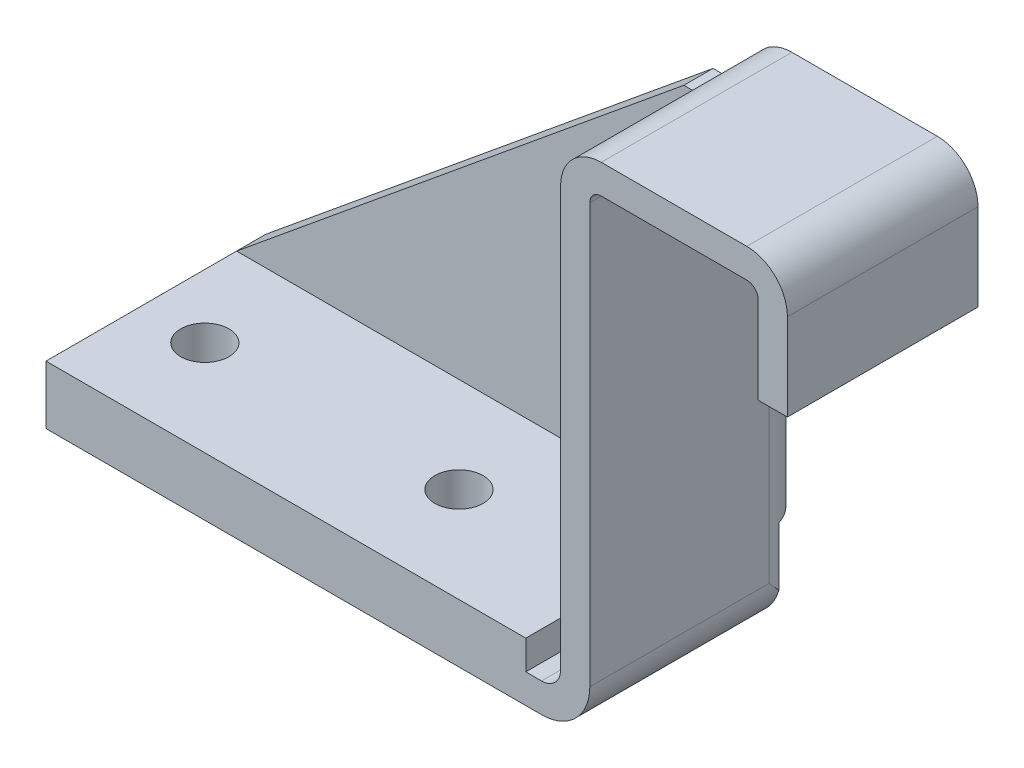
ISO-10303-21;
HEADER;
FILE_DESCRIPTION(('STEP AP214'),'2;1');
FILE_NAME('part.step','',(''),(''),'','','');
FILE_SCHEMA(('AUTOMOTIVE_DESIGN { 1 0 10303 214 1 1 1 1 }'));
ENDSEC;
DATA;
#1=APPLICATION_CONTEXT('core data for automotive mechanical design processes');
#2=APPLICATION_PROTOCOL_DEFINITION('international standard','automotive_design',2000,#1);
#3=PRODUCT_CONTEXT('',#1,'mechanical');
#4=PRODUCT('Part','Part','',(#3));
#5=PRODUCT_RELATED_PRODUCT_CATEGORY('part','',(#4));
#6=PRODUCT_DEFINITION_FORMATION('','',#4);
#7=PRODUCT_DEFINITION_CONTEXT('part definition',#1,'design');
#8=PRODUCT_DEFINITION('design','',#6,#7);
#9=PRODUCT_DEFINITION_SHAPE('','',#8);
#10=(LENGTH_UNIT() NAMED_UNIT(*) SI_UNIT(.MILLI.,.METRE.));
#11=(NAMED_UNIT(*) PLANE_ANGLE_UNIT() SI_UNIT($,.RADIAN.));
#12=(NAMED_UNIT(*) SI_UNIT($,.STERADIAN.) SOLID_ANGLE_UNIT());
#13=UNCERTAINTY_MEASURE_WITH_UNIT(LENGTH_MEASURE(1.E-05),#10,'distance_accuracy_value','');
#14=(GEOMETRIC_REPRESENTATION_CONTEXT(3) GLOBAL_UNCERTAINTY_ASSIGNED_CONTEXT((#13)) GLOBAL_UNIT_ASSIGNED_CONTEXT((#10,
#11,#12)) REPRESENTATION_CONTEXT('',''));
#15=CARTESIAN_POINT('',(0.,0.,0.));
#16=DIRECTION('',(0.,0.,1.));
#17=DIRECTION('',(1.,0.,0.));
#18=AXIS2_PLACEMENT_3D('',#15,#16,#17);
#19=CARTESIAN_POINT('',(356.4255,792.226,0.));
#20=DIRECTION('',(0.,0.,-1.));
#21=DIRECTION('',(-1.,0.,0.));
#22=AXIS2_PLACEMENT_3D('',#19,#20,#21);
#23=PLANE('',#22);
#24=DIRECTION('',(1.,0.,0.));
#25=VECTOR('',#24,1.);
#26=CARTESIAN_POINT('',(361.2515,796.82051965016,0.));
#27=LINE('',#26,#25);
#28=CARTESIAN_POINT('',(358.3305,796.82051965016,0.));
#29=VERTEX_POINT('',#28);
#30=CARTESIAN_POINT('',(361.087454743327,796.82051965016,0.));
#31=VERTEX_POINT('',#30);
#32=EDGE_CURVE('E314',#29,#31,#27,.T.);
#33=ORIENTED_EDGE('',*,*,#32,.T.);
#34=DIRECTION('',(0.,-1.,0.));
#35=VECTOR('',#34,1.);
#36=CARTESIAN_POINT('',(361.087454743327,796.82051965016,0.));
#37=LINE('',#36,#35);
#38=CARTESIAN_POINT('',(361.087454743327,790.978420755555,0.));
#39=VERTEX_POINT('',#38);
#40=EDGE_CURVE('E42',#31,#39,#37,.T.);
#41=ORIENTED_EDGE('',*,*,#40,.T.);
#42=CARTESIAN_POINT('',(356.4255,792.226,0.));
#43=DIRECTION('',(0.,0.,1.));
#44=DIRECTION('',(1.,0.,0.));
#45=AXIS2_PLACEMENT_3D('',#42,#43,#44);
#46=CIRCLE('',#45,4.826);
#47=CARTESIAN_POINT('',(356.4255,787.4,0.));
#48=VERTEX_POINT('',#47);
#49=EDGE_CURVE('E464',#48,#39,#46,.T.);
#50=ORIENTED_EDGE('',*,*,#49,.F.);
#51=DIRECTION('',(1.,0.,0.));
#52=VECTOR('',#51,1.);
#53=CARTESIAN_POINT('',(306.8955,787.4,0.));
#54=LINE('',#53,#52);
#55=CARTESIAN_POINT('',(306.8955,787.4,0.));
#56=VERTEX_POINT('',#55);
#57=EDGE_CURVE('E307',#56,#48,#54,.T.);
#58=ORIENTED_EDGE('',*,*,#57,.F.);
#59=DIRECTION('',(0.,-1.,0.));
#60=VECTOR('',#59,1.);
#61=CARTESIAN_POINT('',(306.8955,790.321,0.));
#62=LINE('',#61,#60);
#63=CARTESIAN_POINT('',(306.8955,790.321,0.));
#64=VERTEX_POINT('',#63);
#65=EDGE_CURVE('E304',#64,#56,#62,.T.);
#66=ORIENTED_EDGE('',*,*,#65,.F.);
#67=DIRECTION('',(1.,0.,0.));
#68=VECTOR('',#67,1.);
#69=CARTESIAN_POINT('',(354.8507,790.321,0.));
#70=LINE('',#69,#68);
#71=CARTESIAN_POINT('',(354.8507,790.321,0.));
#72=VERTEX_POINT('',#71);
#73=EDGE_CURVE('E248',#64,#72,#70,.T.);
#74=ORIENTED_EDGE('',*,*,#73,.T.);
#75=DIRECTION('',(-1.,0.,0.));
#76=VECTOR('',#75,1.);
#77=CARTESIAN_POINT('',(356.4255,790.321,0.));
#78=LINE('',#77,#76);
#79=CARTESIAN_POINT('',(356.4255,790.321,0.));
#80=VERTEX_POINT('',#79);
#81=EDGE_CURVE('E301',#80,#72,#78,.T.);
#82=ORIENTED_EDGE('',*,*,#81,.F.);
#83=CARTESIAN_POINT('',(356.4255,792.226,0.));
#84=DIRECTION('',(0.,0.,-1.));
#85=DIRECTION('',(-1.,0.,0.));
#86=AXIS2_PLACEMENT_3D('',#83,#84,#85);
#87=CIRCLE('',#86,1.90499999999999);
#88=CARTESIAN_POINT('',(358.3305,792.226,0.));
#89=VERTEX_POINT('',#88);
#90=EDGE_CURVE('E262',#89,#80,#87,.T.);
#91=ORIENTED_EDGE('',*,*,#90,.F.);
#92=DIRECTION('',(0.,-1.,0.));
#93=VECTOR('',#92,1.);
#94=CARTESIAN_POINT('',(358.3305,834.136,0.));
#95=LINE('',#94,#93);
#96=EDGE_CURVE('E379',#29,#89,#95,.T.);
#97=ORIENTED_EDGE('',*,*,#96,.F.);
#98=EDGE_LOOP('',(#33,#41,#50,#58,#66,#74,#82,#91,#97));
#99=FACE_BOUND('',#98,.T.);
#100=ADVANCED_FACE('F32',(#99),#23,.T.);
#101=CARTESIAN_POINT('',(362.3945,834.136,0.));
#102=DIRECTION('',(0.,0.,-1.));
#103=DIRECTION('',(-1.,0.,0.));
#104=AXIS2_PLACEMENT_3D('',#101,#102,#103);
#105=CIRCLE('',#104,1.30704525667288);
#106=CARTESIAN_POINT('',(363.028470269801,835.279,0.));
#107=VERTEX_POINT('',#106);
#108=CARTESIAN_POINT('',(361.087454743327,834.136,0.));
#109=VERTEX_POINT('',#108);
#110=EDGE_CURVE('E341',#107,#109,#105,.F.);
#111=ORIENTED_EDGE('',*,*,#110,.T.);
#112=DIRECTION('',(0.,-1.,0.));
#113=VECTOR('',#112,1.);
#114=CARTESIAN_POINT('',(361.087454743327,834.136,0.));
#115=LINE('',#114,#113);
#116=CARTESIAN_POINT('',(361.087454743327,829.945,0.));
#117=VERTEX_POINT('',#116);
#118=EDGE_CURVE('E573',#109,#117,#115,.T.);
#119=ORIENTED_EDGE('',*,*,#118,.T.);
#120=DIRECTION('',(-1.,0.,0.));
#121=VECTOR('',#120,1.);
#122=CARTESIAN_POINT('',(351.5995,829.945,0.));
#123=LINE('',#122,#121);
#124=CARTESIAN_POINT('',(358.3305,829.945,0.));
#125=VERTEX_POINT('',#124);
#126=EDGE_CURVE('E342',#117,#125,#123,.T.);
#127=ORIENTED_EDGE('',*,*,#126,.T.);
#128=CARTESIAN_POINT('',(358.3305,834.136,0.));
#129=VERTEX_POINT('',#128);
#130=EDGE_CURVE('E267',#129,#125,#95,.T.);
#131=ORIENTED_EDGE('',*,*,#130,.F.);
#132=CARTESIAN_POINT('',(362.3945,834.136,0.));
#133=DIRECTION('',(0.,0.,1.));
#134=DIRECTION('',(1.,0.,0.));
#135=AXIS2_PLACEMENT_3D('',#132,#133,#134);
#136=CIRCLE('',#135,4.06399999999998);
#137=CARTESIAN_POINT('',(362.3945,838.2,0.));
#138=VERTEX_POINT('',#137);
#139=EDGE_CURVE('E383',#138,#129,#136,.T.);
#140=ORIENTED_EDGE('',*,*,#139,.F.);
#141=DIRECTION('',(-1.,0.,0.));
#142=VECTOR('',#141,1.);
#143=CARTESIAN_POINT('',(376.936,838.2,0.));
#144=LINE('',#143,#142);
#145=CARTESIAN_POINT('',(376.936,838.2,0.));
#146=VERTEX_POINT('',#145);
#147=EDGE_CURVE('E450',#146,#138,#144,.T.);
#148=ORIENTED_EDGE('',*,*,#147,.F.);
#149=CARTESIAN_POINT('',(376.936,834.136,0.));
#150=DIRECTION('',(0.,0.,1.));
#151=DIRECTION('',(1.,0.,0.));
#152=AXIS2_PLACEMENT_3D('',#149,#150,#151);
#153=CIRCLE('',#152,4.06399999999987);
#154=CARTESIAN_POINT('',(381.,834.136,0.));
#155=VERTEX_POINT('',#154);
#156=EDGE_CURVE('E451',#155,#146,#153,.T.);
#157=ORIENTED_EDGE('',*,*,#156,.F.);
#158=DIRECTION('',(0.,1.,0.));
#159=VECTOR('',#158,1.);
#160=CARTESIAN_POINT('',(381.,825.4492,0.));
#161=LINE('',#160,#159);
#162=CARTESIAN_POINT('',(381.,825.4492,0.));
#163=VERTEX_POINT('',#162);
#164=EDGE_CURVE('E453',#163,#155,#161,.T.);
#165=ORIENTED_EDGE('',*,*,#164,.F.);
#166=DIRECTION('',(1.,0.,0.));
#167=VECTOR('',#166,1.);
#168=CARTESIAN_POINT('',(378.079,825.4492,0.));
#169=LINE('',#168,#167);
#170=CARTESIAN_POINT('',(378.079,825.4492,0.));
#171=VERTEX_POINT('',#170);
#172=EDGE_CURVE('E457',#171,#163,#169,.T.);
#173=ORIENTED_EDGE('',*,*,#172,.F.);
#174=DIRECTION('',(0.,-1.,0.));
#175=VECTOR('',#174,1.);
#176=CARTESIAN_POINT('',(378.079,834.136,0.));
#177=LINE('',#176,#175);
#178=CARTESIAN_POINT('',(378.079,834.136,0.));
#179=VERTEX_POINT('',#178);
#180=EDGE_CURVE('E459',#179,#171,#177,.T.);
#181=ORIENTED_EDGE('',*,*,#180,.F.);
#182=CARTESIAN_POINT('',(376.936,834.136,0.));
#183=DIRECTION('',(0.,0.,-1.));
#184=DIRECTION('',(-1.,0.,0.));
#185=AXIS2_PLACEMENT_3D('',#182,#183,#184);
#186=CIRCLE('',#185,1.14300000000001);
#187=CARTESIAN_POINT('',(376.936,835.279,0.));
#188=VERTEX_POINT('',#187);
#189=EDGE_CURVE('E461',#188,#179,#186,.T.);
#190=ORIENTED_EDGE('',*,*,#189,.F.);
#191=DIRECTION('',(1.,0.,0.));
#192=VECTOR('',#191,1.);
#193=CARTESIAN_POINT('',(362.3945,835.279,0.));
#194=LINE('',#193,#192);
#195=EDGE_CURVE('E463',#107,#188,#194,.T.);
#196=ORIENTED_EDGE('',*,*,#195,.F.);
#197=EDGE_LOOP('',(#111,#119,#127,#131,#140,#148,#157,#165,#173,#181,#190,#196));
#198=FACE_BOUND('',#197,.T.);
#199=ADVANCED_FACE('F514',(#198),#23,.T.);
#200=CARTESIAN_POINT('',(356.4255,790.321,19.0500000000001));
#201=DIRECTION('',(0.,-1.,0.));
#202=DIRECTION('',(1.,0.,0.));
#203=AXIS2_PLACEMENT_3D('',#200,#201,#202);
#204=PLANE('',#203);
#205=DIRECTION('',(0.,0.,-1.));
#206=VECTOR('',#205,1.);
#207=CARTESIAN_POINT('',(354.8507,790.321,19.0500000000001));
#208=LINE('',#207,#206);
#209=CARTESIAN_POINT('',(354.8507,790.321,19.0500000000001));
#210=VERTEX_POINT('',#209);
#211=EDGE_CURVE('E257',#210,#72,#208,.T.);
#212=ORIENTED_EDGE('',*,*,#211,.F.);
#213=DIRECTION('',(-1.,0.,0.));
#214=VECTOR('',#213,1.);
#215=CARTESIAN_POINT('',(356.4255,790.321,19.0500000000001));
#216=LINE('',#215,#214);
#217=CARTESIAN_POINT('',(356.4255,790.321,19.0500000000001));
#218=VERTEX_POINT('',#217);
#219=EDGE_CURVE('E266',#218,#210,#216,.T.);
#220=ORIENTED_EDGE('',*,*,#219,.F.);
#221=DIRECTION('',(0.,0.,-1.));
#222=VECTOR('',#221,1.);
#223=CARTESIAN_POINT('',(356.4255,790.321,19.0500000000001));
#224=LINE('',#223,#222);
#225=EDGE_CURVE('E312',#218,#80,#224,.T.);
#226=ORIENTED_EDGE('',*,*,#225,.T.);
#227=ORIENTED_EDGE('',*,*,#81,.T.);
#228=EDGE_LOOP('',(#212,#220,#226,#227));
#229=FACE_BOUND('',#228,.T.);
#230=ADVANCED_FACE('F434',(#229),#204,.F.);
#231=CARTESIAN_POINT('',(356.4255,792.226,19.0500000000001));
#232=DIRECTION('',(0.,0.,-1.));
#233=DIRECTION('',(-1.,0.,0.));
#234=AXIS2_PLACEMENT_3D('',#231,#232,#233);
#235=CYLINDRICAL_SURFACE('',#234,1.90499999999999);
#236=ORIENTED_EDGE('',*,*,#90,.T.);
#237=ORIENTED_EDGE('',*,*,#225,.F.);
#238=CARTESIAN_POINT('',(356.4255,792.226,19.0500000000001));
#239=DIRECTION('',(0.,0.,-1.));
#240=DIRECTION('',(-1.,0.,0.));
#241=AXIS2_PLACEMENT_3D('',#238,#239,#240);
#242=CIRCLE('',#241,1.90499999999999);
#243=CARTESIAN_POINT('',(358.3305,792.226,19.0500000000001));
#244=VERTEX_POINT('',#243);
#245=EDGE_CURVE('E263',#244,#218,#242,.T.);
#246=ORIENTED_EDGE('',*,*,#245,.F.);
#247=DIRECTION('',(0.,0.,-1.));
#248=VECTOR('',#247,1.);
#249=CARTESIAN_POINT('',(358.3305,792.226,19.0500000000001));
#250=LINE('',#249,#248);
#251=EDGE_CURVE('E298',#244,#89,#250,.T.);
#252=ORIENTED_EDGE('',*,*,#251,.T.);
#253=EDGE_LOOP('',(#236,#237,#246,#252));
#254=FACE_BOUND('',#253,.T.);
#255=ADVANCED_FACE('F437',(#254),#235,.F.);
#256=CARTESIAN_POINT('',(306.8955,790.321,19.0500000000001));
#257=DIRECTION('',(1.,0.,0.));
#258=DIRECTION('',(0.,0.,-1.));
#259=AXIS2_PLACEMENT_3D('',#256,#257,#258);
#260=PLANE('',#259);
#261=DIRECTION('',(0.,0.,1.));
#262=VECTOR('',#261,1.);
#263=CARTESIAN_POINT('',(306.8955,793.242,-2.92100000000001));
#264=LINE('',#263,#262);
#265=CARTESIAN_POINT('',(306.8955,793.242,-2.8013305655735));
#266=VERTEX_POINT('',#265);
#267=CARTESIAN_POINT('',(306.8955,793.242,0.));
#268=VERTEX_POINT('',#267);
#269=EDGE_CURVE('E322',#266,#268,#264,.T.);
#270=ORIENTED_EDGE('',*,*,#269,.F.);
#271=CARTESIAN_POINT('',(306.8955,794.220954743327,1.14300000000001));
#272=DIRECTION('',(1.,0.,0.));
#273=DIRECTION('',(0.,0.,-1.));
#274=AXIS2_PLACEMENT_3D('',#271,#272,#273);
#275=CIRCLE('',#274,4.064);
#276=EDGE_CURVE('E334',#266,#64,#275,.F.);
#277=ORIENTED_EDGE('',*,*,#276,.T.);
#278=ORIENTED_EDGE('',*,*,#65,.T.);
#279=DIRECTION('',(0.,0.,-1.));
#280=VECTOR('',#279,1.);
#281=CARTESIAN_POINT('',(306.8955,787.4,19.0500000000001));
#282=LINE('',#281,#280);
#283=CARTESIAN_POINT('',(306.8955,787.4,19.0500000000001));
#284=VERTEX_POINT('',#283);
#285=EDGE_CURVE('E426',#284,#56,#282,.T.);
#286=ORIENTED_EDGE('',*,*,#285,.F.);
#287=DIRECTION('',(0.,-1.,0.));
#288=VECTOR('',#287,1.);
#289=CARTESIAN_POINT('',(306.8955,790.321,19.0500000000001));
#290=LINE('',#289,#288);
#291=CARTESIAN_POINT('',(306.8955,793.242,19.0500000000001));
#292=VERTEX_POINT('',#291);
#293=EDGE_CURVE('E270',#292,#284,#290,.T.);
#294=ORIENTED_EDGE('',*,*,#293,.F.);
#295=DIRECTION('',(0.,0.,-1.));
#296=VECTOR('',#295,1.);
#297=CARTESIAN_POINT('',(306.8955,793.242,19.0500000000001));
#298=LINE('',#297,#296);
#299=EDGE_CURVE('E259',#292,#268,#298,.T.);
#300=ORIENTED_EDGE('',*,*,#299,.T.);
#301=EDGE_LOOP('',(#270,#277,#278,#286,#294,#300));
#302=FACE_BOUND('',#301,.T.);
#303=ADVANCED_FACE('F366',(#302),#260,.F.);
#304=CARTESIAN_POINT('',(306.8955,787.4,19.0500000000001));
#305=DIRECTION('',(0.,1.,0.));
#306=DIRECTION('',(0.,0.,1.));
#307=AXIS2_PLACEMENT_3D('',#304,#305,#306);
#308=PLANE('',#307);
#309=CARTESIAN_POINT('',(338.6455,787.4,9.52500000000006));
#310=DIRECTION('',(0.,-1.,0.));
#311=DIRECTION('',(0.,0.,-1.));
#312=AXIS2_PLACEMENT_3D('',#309,#310,#311);
#313=CIRCLE('',#312,2.41299999999999);
#314=CARTESIAN_POINT('',(338.6455,787.4,7.11200000000006));
#315=VERTEX_POINT('',#314);
#316=EDGE_CURVE('E606',#315,#315,#313,.T.);
#317=ORIENTED_EDGE('',*,*,#316,.F.);
#318=EDGE_LOOP('',(#317));
#319=FACE_BOUND('',#318,.T.);
#320=CARTESIAN_POINT('',(313.2455,787.4,9.52500000000006));
#321=DIRECTION('',(0.,-1.,0.));
#322=DIRECTION('',(0.,0.,-1.));
#323=AXIS2_PLACEMENT_3D('',#320,#321,#322);
#324=CIRCLE('',#323,2.41299999999999);
#325=CARTESIAN_POINT('',(313.2455,787.4,7.11200000000006));
#326=VERTEX_POINT('',#325);
#327=EDGE_CURVE('E597',#326,#326,#324,.T.);
#328=ORIENTED_EDGE('',*,*,#327,.F.);
#329=EDGE_LOOP('',(#328));
#330=FACE_BOUND('',#329,.T.);
#331=ORIENTED_EDGE('',*,*,#57,.T.);
#332=DIRECTION('',(0.,0.,-1.));
#333=VECTOR('',#332,1.);
#334=CARTESIAN_POINT('',(356.4255,787.4,19.0500000000001));
#335=LINE('',#334,#333);
#336=CARTESIAN_POINT('',(356.4255,787.4,19.0500000000001));
#337=VERTEX_POINT('',#336);
#338=EDGE_CURVE('E424',#337,#48,#335,.T.);
#339=ORIENTED_EDGE('',*,*,#338,.F.);
#340=DIRECTION('',(1.,0.,0.));
#341=VECTOR('',#340,1.);
#342=CARTESIAN_POINT('',(306.8955,787.4,19.0500000000001));
#343=LINE('',#342,#341);
#344=EDGE_CURVE('E272',#284,#337,#343,.T.);
#345=ORIENTED_EDGE('',*,*,#344,.F.);
#346=ORIENTED_EDGE('',*,*,#285,.T.);
#347=EDGE_LOOP('',(#331,#339,#345,#346));
#348=FACE_BOUND('',#347,.T.);
#349=ADVANCED_FACE('F468',(#319,#330,#348),#308,.F.);
#350=CARTESIAN_POINT('',(356.4255,792.226,19.0500000000001));
#351=DIRECTION('',(0.,0.,-1.));
#352=DIRECTION('',(-1.,0.,0.));
#353=AXIS2_PLACEMENT_3D('',#350,#351,#352);
#354=CYLINDRICAL_SURFACE('',#353,4.826);
#355=ORIENTED_EDGE('',*,*,#49,.T.);
#356=CARTESIAN_POINT('',(361.087454743327,790.978420755555,0.));
#357=CARTESIAN_POINT('',(361.114795327784,791.080621794301,0.0933195113702025));
#358=CARTESIAN_POINT('',(361.138663268097,791.183234788616,0.187135363436242));
#359=CARTESIAN_POINT('',(361.179548210284,791.389134706904,0.375561001679142));
#360=CARTESIAN_POINT('',(361.196563840431,791.492421761613,0.470170942954715));
#361=CARTESIAN_POINT('',(361.237322971748,791.801970083546,0.753886615539928));
#362=CARTESIAN_POINT('',(361.251050548197,792.008946069466,0.943817704125921));
#363=CARTESIAN_POINT('',(361.251496379332,792.219175476468,1.13673738787016));
#364=CARTESIAN_POINT('',(361.251499998218,792.222587762367,1.13986871616857));
#365=CARTESIAN_POINT('',(361.2515,792.226,1.14300000000001));
#366=B_SPLINE_CURVE_WITH_KNOTS('',3,(#356,#357,#358,#359,#360,#361,#362,#363,#364,#365),
.UNSPECIFIED.,.F.,.F.,(4,2,2,2,4),(0.,0.423080849383119,0.846246351027394,1.6883378195487,
1.70223170733719),.UNSPECIFIED.);
#367=CARTESIAN_POINT('',(361.2515,792.226,1.14300000000001));
#368=VERTEX_POINT('',#367);
#369=EDGE_CURVE('E11',#39,#368,#366,.T.);
#370=ORIENTED_EDGE('',*,*,#369,.T.);
#371=DIRECTION('',(0.,0.,-1.));
#372=VECTOR('',#371,1.);
#373=CARTESIAN_POINT('',(361.2515,792.226,19.0500000000001));
#374=LINE('',#373,#372);
#375=CARTESIAN_POINT('',(361.2515,792.226,19.0500000000001));
#376=VERTEX_POINT('',#375);
#377=EDGE_CURVE('E421',#376,#368,#374,.T.);
#378=ORIENTED_EDGE('',*,*,#377,.F.);
#379=CARTESIAN_POINT('',(356.4255,792.226,19.0500000000001));
#380=DIRECTION('',(0.,0.,1.));
#381=DIRECTION('',(1.,0.,0.));
#382=AXIS2_PLACEMENT_3D('',#379,#380,#381);
#383=CIRCLE('',#382,4.826);
#384=EDGE_CURVE('E274',#337,#376,#383,.T.);
#385=ORIENTED_EDGE('',*,*,#384,.F.);
#386=ORIENTED_EDGE('',*,*,#338,.T.);
#387=EDGE_LOOP('',(#355,#370,#378,#385,#386));
#388=FACE_BOUND('',#387,.T.);
#389=ADVANCED_FACE('F471',(#388),#354,.T.);
#390=CARTESIAN_POINT('',(361.2515,792.226,19.0500000000001));
#391=DIRECTION('',(-1.,0.,0.));
#392=DIRECTION('',(0.,0.,1.));
#393=AXIS2_PLACEMENT_3D('',#390,#391,#392);
#394=PLANE('',#393);
#395=ORIENTED_EDGE('',*,*,#377,.T.);
#396=DIRECTION('',(0.,1.,0.));
#397=VECTOR('',#396,1.);
#398=CARTESIAN_POINT('',(361.2515,829.945,1.14300000000001));
#399=LINE('',#398,#397);
#400=CARTESIAN_POINT('',(361.2515,834.136,1.14300000000001));
#401=VERTEX_POINT('',#400);
#402=EDGE_CURVE('E336',#368,#401,#399,.T.);
#403=ORIENTED_EDGE('',*,*,#402,.T.);
#404=DIRECTION('',(0.,0.,-1.));
#405=VECTOR('',#404,1.);
#406=CARTESIAN_POINT('',(361.2515,834.136,19.0500000000001));
#407=LINE('',#406,#405);
#408=CARTESIAN_POINT('',(361.2515,834.136,19.0500000000001));
#409=VERTEX_POINT('',#408);
#410=EDGE_CURVE('E418',#409,#401,#407,.T.);
#411=ORIENTED_EDGE('',*,*,#410,.F.);
#412=DIRECTION('',(0.,1.,0.));
#413=VECTOR('',#412,1.);
#414=CARTESIAN_POINT('',(361.2515,792.226,19.0500000000001));
#415=LINE('',#414,#413);
#416=EDGE_CURVE('E276',#376,#409,#415,.T.);
#417=ORIENTED_EDGE('',*,*,#416,.F.);
#418=EDGE_LOOP('',(#395,#403,#411,#417));
#419=FACE_BOUND('',#418,.T.);
#420=ADVANCED_FACE('F505',(#419),#394,.F.);
#421=CARTESIAN_POINT('',(362.3945,834.136,19.0500000000001));
#422=DIRECTION('',(0.,0.,-1.));
#423=DIRECTION('',(-1.,0.,0.));
#424=AXIS2_PLACEMENT_3D('',#421,#422,#423);
#425=CYLINDRICAL_SURFACE('',#424,1.14300000000003);
#426=ORIENTED_EDGE('',*,*,#410,.T.);
#427=CARTESIAN_POINT('',(362.3945,834.136,1.14300000000001));
#428=DIRECTION('',(0.,0.,-1.));
#429=DIRECTION('',(-1.,0.,0.));
#430=AXIS2_PLACEMENT_3D('',#427,#428,#429);
#431=CIRCLE('',#430,1.14300000000003);
#432=CARTESIAN_POINT('',(362.3945,835.279,1.14300000000001));
#433=VERTEX_POINT('',#432);
#434=EDGE_CURVE('E487',#401,#433,#431,.T.);
#435=ORIENTED_EDGE('',*,*,#434,.T.);
#436=DIRECTION('',(0.,0.,-1.));
#437=VECTOR('',#436,1.);
#438=CARTESIAN_POINT('',(362.3945,835.279,19.0500000000001));
#439=LINE('',#438,#437);
#440=CARTESIAN_POINT('',(362.3945,835.279,19.0500000000001));
#441=VERTEX_POINT('',#440);
#442=EDGE_CURVE('E415',#441,#433,#439,.T.);
#443=ORIENTED_EDGE('',*,*,#442,.F.);
#444=CARTESIAN_POINT('',(362.3945,834.136,19.0500000000001));
#445=DIRECTION('',(0.,0.,-1.));
#446=DIRECTION('',(-1.,0.,0.));
#447=AXIS2_PLACEMENT_3D('',#444,#445,#446);
#448=CIRCLE('',#447,1.14300000000003);
#449=EDGE_CURVE('E278',#409,#441,#448,.T.);
#450=ORIENTED_EDGE('',*,*,#449,.F.);
#451=EDGE_LOOP('',(#426,#435,#443,#450));
#452=FACE_BOUND('',#451,.T.);
#453=ADVANCED_FACE('F560',(#452),#425,.F.);
#454=CARTESIAN_POINT('',(362.3945,835.279,19.0500000000001));
#455=DIRECTION('',(0.,1.,0.));
#456=DIRECTION('',(0.,0.,1.));
#457=AXIS2_PLACEMENT_3D('',#454,#455,#456);
#458=PLANE('',#457);
#459=ORIENTED_EDGE('',*,*,#442,.T.);
#460=CARTESIAN_POINT('',(363.028470269801,835.279,0.));
#461=CARTESIAN_POINT('',(362.916849340827,835.279,0.184615844499899));
#462=CARTESIAN_POINT('',(362.810442364593,835.279,0.372154180899349));
#463=CARTESIAN_POINT('',(362.602817617344,835.279,0.750366541628903));
#464=CARTESIAN_POINT('',(362.501605351557,835.279,0.941043620865379));
#465=CARTESIAN_POINT('',(362.398482389956,835.279,1.1354907193236));
#466=CARTESIAN_POINT('',(362.396491189189,835.279,1.13924536224221));
#467=CARTESIAN_POINT('',(362.3945,835.279,1.14300000000001));
#468=B_SPLINE_CURVE_WITH_KNOTS('',3,(#460,#461,#462,#463,#464,#465,#466,#467),.UNSPECIFIED.,.F.,
.F.,(4,2,2,4),(0.,0.646876716528991,1.29442539148645,1.30717529342893),.UNSPECIFIED.);
#469=EDGE_CURVE('E484',#433,#107,#468,.F.);
#470=ORIENTED_EDGE('',*,*,#469,.T.);
#471=ORIENTED_EDGE('',*,*,#195,.T.);
#472=DIRECTION('',(0.,0.,-1.));
#473=VECTOR('',#472,1.);
#474=CARTESIAN_POINT('',(376.936,835.279,19.0500000000001));
#475=LINE('',#474,#473);
#476=CARTESIAN_POINT('',(376.936,835.279,19.0500000000001));
#477=VERTEX_POINT('',#476);
#478=EDGE_CURVE('E412',#477,#188,#475,.T.);
#479=ORIENTED_EDGE('',*,*,#478,.F.);
#480=DIRECTION('',(1.,0.,0.));
#481=VECTOR('',#480,1.);
#482=CARTESIAN_POINT('',(362.3945,835.279,19.0500000000001));
#483=LINE('',#482,#481);
#484=EDGE_CURVE('E280',#441,#477,#483,.T.);
#485=ORIENTED_EDGE('',*,*,#484,.F.);
#486=EDGE_LOOP('',(#459,#470,#471,#479,#485));
#487=FACE_BOUND('',#486,.T.);
#488=ADVANCED_FACE('F556',(#487),#458,.F.);
#489=CARTESIAN_POINT('',(376.936,834.136,19.0500000000001));
#490=DIRECTION('',(0.,0.,-1.));
#491=DIRECTION('',(-1.,0.,0.));
#492=AXIS2_PLACEMENT_3D('',#489,#490,#491);
#493=CYLINDRICAL_SURFACE('',#492,1.14300000000001);
#494=ORIENTED_EDGE('',*,*,#189,.T.);
#495=DIRECTION('',(0.,0.,-1.));
#496=VECTOR('',#495,1.);
#497=CARTESIAN_POINT('',(378.079,834.136,19.0500000000001));
#498=LINE('',#497,#496);
#499=CARTESIAN_POINT('',(378.079,834.136,19.0500000000001));
#500=VERTEX_POINT('',#499);
#501=EDGE_CURVE('E409',#500,#179,#498,.T.);
#502=ORIENTED_EDGE('',*,*,#501,.F.);
#503=CARTESIAN_POINT('',(376.936,834.136,19.0500000000001));
#504=DIRECTION('',(0.,0.,-1.));
#505=DIRECTION('',(-1.,0.,0.));
#506=AXIS2_PLACEMENT_3D('',#503,#504,#505);
#507=CIRCLE('',#506,1.14300000000001);
#508=EDGE_CURVE('E282',#477,#500,#507,.T.);
#509=ORIENTED_EDGE('',*,*,#508,.F.);
#510=ORIENTED_EDGE('',*,*,#478,.T.);
#511=EDGE_LOOP('',(#494,#502,#509,#510));
#512=FACE_BOUND('',#511,.T.);
#513=ADVANCED_FACE('F553',(#512),#493,.F.);
#514=CARTESIAN_POINT('',(378.079,834.136,19.0500000000001));
#515=DIRECTION('',(1.,0.,0.));
#516=DIRECTION('',(0.,0.,-1.));
#517=AXIS2_PLACEMENT_3D('',#514,#515,#516);
#518=PLANE('',#517);
#519=ORIENTED_EDGE('',*,*,#180,.T.);
#520=DIRECTION('',(0.,0.,-1.));
#521=VECTOR('',#520,1.);
#522=CARTESIAN_POINT('',(378.079,825.4492,19.0500000000001));
#523=LINE('',#522,#521);
#524=CARTESIAN_POINT('',(378.079,825.4492,19.0500000000001));
#525=VERTEX_POINT('',#524);
#526=EDGE_CURVE('E406',#525,#171,#523,.T.);
#527=ORIENTED_EDGE('',*,*,#526,.F.);
#528=DIRECTION('',(0.,-1.,0.));
#529=VECTOR('',#528,1.);
#530=CARTESIAN_POINT('',(378.079,834.136,19.0500000000001));
#531=LINE('',#530,#529);
#532=EDGE_CURVE('E284',#500,#525,#531,.T.);
#533=ORIENTED_EDGE('',*,*,#532,.F.);
#534=ORIENTED_EDGE('',*,*,#501,.T.);
#535=EDGE_LOOP('',(#519,#527,#533,#534));
#536=FACE_BOUND('',#535,.T.);
#537=ADVANCED_FACE('F549',(#536),#518,.F.);
#538=CARTESIAN_POINT('',(378.079,825.4492,19.0500000000001));
#539=DIRECTION('',(0.,1.,0.));
#540=DIRECTION('',(0.,0.,1.));
#541=AXIS2_PLACEMENT_3D('',#538,#539,#540);
#542=PLANE('',#541);
#543=ORIENTED_EDGE('',*,*,#172,.T.);
#544=DIRECTION('',(0.,0.,-1.));
#545=VECTOR('',#544,1.);
#546=CARTESIAN_POINT('',(381.,825.4492,19.0500000000001));
#547=LINE('',#546,#545);
#548=CARTESIAN_POINT('',(381.,825.4492,19.0500000000001));
#549=VERTEX_POINT('',#548);
#550=EDGE_CURVE('E403',#549,#163,#547,.T.);
#551=ORIENTED_EDGE('',*,*,#550,.F.);
#552=DIRECTION('',(1.,0.,0.));
#553=VECTOR('',#552,1.);
#554=CARTESIAN_POINT('',(378.079,825.4492,19.0500000000001));
#555=LINE('',#554,#553);
#556=EDGE_CURVE('E286',#525,#549,#555,.T.);
#557=ORIENTED_EDGE('',*,*,#556,.F.);
#558=ORIENTED_EDGE('',*,*,#526,.T.);
#559=EDGE_LOOP('',(#543,#551,#557,#558));
#560=FACE_BOUND('',#559,.T.);
#561=ADVANCED_FACE('F545',(#560),#542,.F.);
#562=CARTESIAN_POINT('',(381.,825.4492,19.0500000000001));
#563=DIRECTION('',(-1.,0.,0.));
#564=DIRECTION('',(0.,0.,1.));
#565=AXIS2_PLACEMENT_3D('',#562,#563,#564);
#566=PLANE('',#565);
#567=ORIENTED_EDGE('',*,*,#164,.T.);
#568=DIRECTION('',(0.,0.,-1.));
#569=VECTOR('',#568,1.);
#570=CARTESIAN_POINT('',(381.,834.136,19.0500000000001));
#571=LINE('',#570,#569);
#572=CARTESIAN_POINT('',(381.,834.136,19.0500000000001));
#573=VERTEX_POINT('',#572);
#574=EDGE_CURVE('E400',#573,#155,#571,.T.);
#575=ORIENTED_EDGE('',*,*,#574,.F.);
#576=DIRECTION('',(0.,1.,0.));
#577=VECTOR('',#576,1.);
#578=CARTESIAN_POINT('',(381.,825.4492,19.0500000000001));
#579=LINE('',#578,#577);
#580=EDGE_CURVE('E288',#549,#573,#579,.T.);
#581=ORIENTED_EDGE('',*,*,#580,.F.);
#582=ORIENTED_EDGE('',*,*,#550,.T.);
#583=EDGE_LOOP('',(#567,#575,#581,#582));
#584=FACE_BOUND('',#583,.T.);
#585=ADVANCED_FACE('F541',(#584),#566,.F.);
#586=CARTESIAN_POINT('',(376.936,834.136,19.0500000000001));
#587=DIRECTION('',(0.,0.,-1.));
#588=DIRECTION('',(-1.,0.,0.));
#589=AXIS2_PLACEMENT_3D('',#586,#587,#588);
#590=CYLINDRICAL_SURFACE('',#589,4.06399999999987);
#591=ORIENTED_EDGE('',*,*,#156,.T.);
#592=DIRECTION('',(0.,0.,-1.));
#593=VECTOR('',#592,1.);
#594=CARTESIAN_POINT('',(376.936,838.2,19.0500000000001));
#595=LINE('',#594,#593);
#596=CARTESIAN_POINT('',(376.936,838.2,19.0500000000001));
#597=VERTEX_POINT('',#596);
#598=EDGE_CURVE('E397',#597,#146,#595,.T.);
#599=ORIENTED_EDGE('',*,*,#598,.F.);
#600=CARTESIAN_POINT('',(376.936,834.136,19.0500000000001));
#601=DIRECTION('',(0.,0.,1.));
#602=DIRECTION('',(1.,0.,0.));
#603=AXIS2_PLACEMENT_3D('',#600,#601,#602);
#604=CIRCLE('',#603,4.06399999999987);
#605=EDGE_CURVE('E290',#573,#597,#604,.T.);
#606=ORIENTED_EDGE('',*,*,#605,.F.);
#607=ORIENTED_EDGE('',*,*,#574,.T.);
#608=EDGE_LOOP('',(#591,#599,#606,#607));
#609=FACE_BOUND('',#608,.T.);
#610=ADVANCED_FACE('F538',(#609),#590,.T.);
#611=CARTESIAN_POINT('',(376.936,838.2,19.0500000000001));
#612=DIRECTION('',(0.,-1.,0.));
#613=DIRECTION('',(0.,0.,-1.));
#614=AXIS2_PLACEMENT_3D('',#611,#612,#613);
#615=PLANE('',#614);
#616=ORIENTED_EDGE('',*,*,#147,.T.);
#617=DIRECTION('',(0.,0.,-1.));
#618=VECTOR('',#617,1.);
#619=CARTESIAN_POINT('',(362.3945,838.2,19.0500000000001));
#620=LINE('',#619,#618);
#621=CARTESIAN_POINT('',(362.3945,838.2,19.0500000000001));
#622=VERTEX_POINT('',#621);
#623=EDGE_CURVE('E394',#622,#138,#620,.T.);
#624=ORIENTED_EDGE('',*,*,#623,.F.);
#625=DIRECTION('',(-1.,0.,0.));
#626=VECTOR('',#625,1.);
#627=CARTESIAN_POINT('',(376.936,838.2,19.0500000000001));
#628=LINE('',#627,#626);
#629=EDGE_CURVE('E292',#597,#622,#628,.T.);
#630=ORIENTED_EDGE('',*,*,#629,.F.);
#631=ORIENTED_EDGE('',*,*,#598,.T.);
#632=EDGE_LOOP('',(#616,#624,#630,#631));
#633=FACE_BOUND('',#632,.T.);
#634=ADVANCED_FACE('F535',(#633),#615,.F.);
#635=CARTESIAN_POINT('',(362.3945,834.136,19.0500000000001));
#636=DIRECTION('',(0.,0.,-1.));
#637=DIRECTION('',(-1.,0.,0.));
#638=AXIS2_PLACEMENT_3D('',#635,#636,#637);
#639=CYLINDRICAL_SURFACE('',#638,4.06399999999998);
#640=ORIENTED_EDGE('',*,*,#139,.T.);
#641=DIRECTION('',(0.,0.,-1.));
#642=VECTOR('',#641,1.);
#643=CARTESIAN_POINT('',(358.3305,834.136,19.0500000000001));
#644=LINE('',#643,#642);
#645=CARTESIAN_POINT('',(358.3305,834.136,19.0500000000001));
#646=VERTEX_POINT('',#645);
#647=EDGE_CURVE('E392',#646,#129,#644,.T.);
#648=ORIENTED_EDGE('',*,*,#647,.F.);
#649=CARTESIAN_POINT('',(362.3945,834.136,19.0500000000001));
#650=DIRECTION('',(0.,0.,1.));
#651=DIRECTION('',(1.,0.,0.));
#652=AXIS2_PLACEMENT_3D('',#649,#650,#651);
#653=CIRCLE('',#652,4.06399999999998);
#654=EDGE_CURVE('E294',#622,#646,#653,.T.);
#655=ORIENTED_EDGE('',*,*,#654,.F.);
#656=ORIENTED_EDGE('',*,*,#623,.T.);
#657=EDGE_LOOP('',(#640,#648,#655,#656));
#658=FACE_BOUND('',#657,.T.);
#659=ADVANCED_FACE('F446',(#658),#639,.T.);
#660=CARTESIAN_POINT('',(358.3305,834.136,19.0500000000001));
#661=DIRECTION('',(1.,0.,0.));
#662=DIRECTION('',(0.,0.,-1.));
#663=AXIS2_PLACEMENT_3D('',#660,#661,#662);
#664=PLANE('',#663);
#665=ORIENTED_EDGE('',*,*,#130,.T.);
#666=EDGE_CURVE('E376',#125,#29,#95,.T.);
#667=ORIENTED_EDGE('',*,*,#666,.T.);
#668=ORIENTED_EDGE('',*,*,#96,.T.);
#669=ORIENTED_EDGE('',*,*,#251,.F.);
#670=DIRECTION('',(0.,-1.,0.));
#671=VECTOR('',#670,1.);
#672=CARTESIAN_POINT('',(358.3305,834.136,19.0500000000001));
#673=LINE('',#672,#671);
#674=EDGE_CURVE('E296',#646,#244,#673,.T.);
#675=ORIENTED_EDGE('',*,*,#674,.F.);
#676=ORIENTED_EDGE('',*,*,#647,.T.);
#677=EDGE_LOOP('',(#665,#667,#668,#669,#675,#676));
#678=FACE_BOUND('',#677,.T.);
#679=ADVANCED_FACE('F385',(#678),#664,.F.);
#680=CARTESIAN_POINT('',(356.4255,792.226,19.0500000000001));
#681=DIRECTION('',(0.,0.,-1.));
#682=DIRECTION('',(-1.,0.,0.));
#683=AXIS2_PLACEMENT_3D('',#680,#681,#682);
#684=PLANE('',#683);
#685=ORIENTED_EDGE('',*,*,#245,.T.);
#686=ORIENTED_EDGE('',*,*,#219,.T.);
#687=DIRECTION('',(0.,1.,0.));
#688=VECTOR('',#687,1.);
#689=CARTESIAN_POINT('',(354.8507,790.321,19.0500000000001));
#690=LINE('',#689,#688);
#691=CARTESIAN_POINT('',(354.8507,793.242,19.0500000000001));
#692=VERTEX_POINT('',#691);
#693=EDGE_CURVE('E253',#210,#692,#690,.T.);
#694=ORIENTED_EDGE('',*,*,#693,.T.);
#695=DIRECTION('',(-1.,0.,0.));
#696=VECTOR('',#695,1.);
#697=CARTESIAN_POINT('',(354.8507,793.242,19.0500000000001));
#698=LINE('',#697,#696);
#699=EDGE_CURVE('E250',#692,#292,#698,.T.);
#700=ORIENTED_EDGE('',*,*,#699,.T.);
#701=ORIENTED_EDGE('',*,*,#293,.T.);
#702=ORIENTED_EDGE('',*,*,#344,.T.);
#703=ORIENTED_EDGE('',*,*,#384,.T.);
#704=ORIENTED_EDGE('',*,*,#416,.T.);
#705=ORIENTED_EDGE('',*,*,#449,.T.);
#706=ORIENTED_EDGE('',*,*,#484,.T.);
#707=ORIENTED_EDGE('',*,*,#508,.T.);
#708=ORIENTED_EDGE('',*,*,#532,.T.);
#709=ORIENTED_EDGE('',*,*,#556,.T.);
#710=ORIENTED_EDGE('',*,*,#580,.T.);
#711=ORIENTED_EDGE('',*,*,#605,.T.);
#712=ORIENTED_EDGE('',*,*,#629,.T.);
#713=ORIENTED_EDGE('',*,*,#654,.T.);
#714=ORIENTED_EDGE('',*,*,#674,.T.);
#715=EDGE_LOOP('',(#685,#686,#694,#700,#701,#702,#703,#704,#705,#706,#707,#708,#709,#710,#711,
#712,#713,#714));
#716=FACE_BOUND('',#715,.T.);
#717=ADVANCED_FACE('F441',(#716),#684,.F.);
#718=CARTESIAN_POINT('',(354.8507,793.242,19.0500000000001));
#719=DIRECTION('',(0.,-1.,0.));
#720=DIRECTION('',(0.,0.,-1.));
#721=AXIS2_PLACEMENT_3D('',#718,#719,#720);
#722=PLANE('',#721);
#723=CARTESIAN_POINT('',(338.6455,793.242,9.52500000000006));
#724=DIRECTION('',(0.,-1.,0.));
#725=DIRECTION('',(0.,0.,-1.));
#726=AXIS2_PLACEMENT_3D('',#723,#724,#725);
#727=CIRCLE('',#726,2.41299999999999);
#728=CARTESIAN_POINT('',(338.6455,793.242,7.11200000000006));
#729=VERTEX_POINT('',#728);
#730=EDGE_CURVE('E601',#729,#729,#727,.F.);
#731=ORIENTED_EDGE('',*,*,#730,.F.);
#732=EDGE_LOOP('',(#731));
#733=FACE_BOUND('',#732,.T.);
#734=CARTESIAN_POINT('',(313.2455,793.242,9.52500000000006));
#735=DIRECTION('',(0.,-1.,0.));
#736=DIRECTION('',(0.,0.,-1.));
#737=AXIS2_PLACEMENT_3D('',#734,#735,#736);
#738=CIRCLE('',#737,2.41299999999999);
#739=CARTESIAN_POINT('',(313.2455,793.242,7.11200000000006));
#740=VERTEX_POINT('',#739);
#741=EDGE_CURVE('E575',#740,#740,#738,.F.);
#742=ORIENTED_EDGE('',*,*,#741,.F.);
#743=EDGE_LOOP('',(#742));
#744=FACE_BOUND('',#743,.T.);
#745=DIRECTION('',(-1.,0.,0.));
#746=VECTOR('',#745,1.);
#747=CARTESIAN_POINT('',(354.8507,793.242,0.));
#748=LINE('',#747,#746);
#749=CARTESIAN_POINT('',(354.8507,793.242,0.));
#750=VERTEX_POINT('',#749);
#751=EDGE_CURVE('E254',#750,#268,#748,.T.);
#752=ORIENTED_EDGE('',*,*,#751,.T.);
#753=ORIENTED_EDGE('',*,*,#299,.F.);
#754=ORIENTED_EDGE('',*,*,#699,.F.);
#755=DIRECTION('',(0.,0.,-1.));
#756=VECTOR('',#755,1.);
#757=CARTESIAN_POINT('',(354.8507,793.242,19.0500000000001));
#758=LINE('',#757,#756);
#759=EDGE_CURVE('E256',#692,#750,#758,.T.);
#760=ORIENTED_EDGE('',*,*,#759,.T.);
#761=EDGE_LOOP('',(#752,#753,#754,#760));
#762=FACE_BOUND('',#761,.T.);
#763=ADVANCED_FACE('F371',(#733,#744,#762),#722,.F.);
#764=CARTESIAN_POINT('',(354.8507,790.321,19.0500000000001));
#765=DIRECTION('',(-1.,0.,0.));
#766=DIRECTION('',(0.,0.,1.));
#767=AXIS2_PLACEMENT_3D('',#764,#765,#766);
#768=PLANE('',#767);
#769=ORIENTED_EDGE('',*,*,#211,.T.);
#770=CARTESIAN_POINT('',(354.8507,794.220954743327,1.14300000000001));
#771=DIRECTION('',(-1.,0.,0.));
#772=DIRECTION('',(0.,0.,1.));
#773=AXIS2_PLACEMENT_3D('',#770,#771,#772);
#774=CIRCLE('',#773,4.064);
#775=CARTESIAN_POINT('',(354.8507,794.220954743327,-2.92100000000001));
#776=VERTEX_POINT('',#775);
#777=EDGE_CURVE('E217',#72,#776,#774,.F.);
#778=ORIENTED_EDGE('',*,*,#777,.T.);
#779=DIRECTION('',(0.,1.,0.));
#780=VECTOR('',#779,1.);
#781=CARTESIAN_POINT('',(354.8507,796.82051965016,-2.92100000000001));
#782=LINE('',#781,#780);
#783=CARTESIAN_POINT('',(354.8507,796.82051965016,-2.92100000000001));
#784=VERTEX_POINT('',#783);
#785=EDGE_CURVE('E210',#776,#784,#782,.T.);
#786=ORIENTED_EDGE('',*,*,#785,.T.);
#787=DIRECTION('',(0.,0.,1.));
#788=VECTOR('',#787,1.);
#789=CARTESIAN_POINT('',(354.8507,796.82051965016,-2.92100000000001));
#790=LINE('',#789,#788);
#791=CARTESIAN_POINT('',(354.8507,796.82051965016,0.));
#792=VERTEX_POINT('',#791);
#793=EDGE_CURVE('E215',#784,#792,#790,.T.);
#794=ORIENTED_EDGE('',*,*,#793,.T.);
#795=DIRECTION('',(0.,1.,0.));
#796=VECTOR('',#795,1.);
#797=CARTESIAN_POINT('',(354.8507,796.82051965016,0.));
#798=LINE('',#797,#796);
#799=EDGE_CURVE('E246',#750,#792,#798,.T.);
#800=ORIENTED_EDGE('',*,*,#799,.F.);
#801=ORIENTED_EDGE('',*,*,#759,.F.);
#802=ORIENTED_EDGE('',*,*,#693,.F.);
#803=EDGE_LOOP('',(#769,#778,#786,#794,#800,#801,#802));
#804=FACE_BOUND('',#803,.T.);
#805=ADVANCED_FACE('F213',(#804),#768,.F.);
#806=CARTESIAN_POINT('',(306.8955,793.242,-2.92100000000001));
#807=DIRECTION('',(-0.634552111197147,0.772880080074034,0.));
#808=DIRECTION('',(-0.772880080074035,-0.634552111197146,0.));
#809=AXIS2_PLACEMENT_3D('',#806,#807,#808);
#810=PLANE('',#809);
#811=DIRECTION('',(-0.772880080074035,-0.634552111197146,0.));
#812=VECTOR('',#811,1.);
#813=CARTESIAN_POINT('',(306.8955,793.242,-2.92100000000001));
#814=LINE('',#813,#812);
#815=CARTESIAN_POINT('',(351.5995,829.945,-2.92100000000001));
#816=VERTEX_POINT('',#815);
#817=CARTESIAN_POINT('',(308.087860102599,794.220954743327,-2.92100000000001));
#818=VERTEX_POINT('',#817);
#819=EDGE_CURVE('E228',#816,#818,#814,.T.);
#820=ORIENTED_EDGE('',*,*,#819,.T.);
#821=CARTESIAN_POINT('',(308.087860102599,794.220954743327,1.14300000000001));
#822=DIRECTION('',(-0.634552111197147,0.772880080074034,0.));
#823=DIRECTION('',(0.772880080074035,0.634552111197146,0.));
#824=AXIS2_PLACEMENT_3D('',#821,#822,#823);
#825=ELLIPSE('',#824,6.40451734110987,4.064);
#826=EDGE_CURVE('E332',#818,#266,#825,.T.);
#827=ORIENTED_EDGE('',*,*,#826,.T.);
#828=ORIENTED_EDGE('',*,*,#269,.T.);
#829=DIRECTION('',(-0.772880080074035,-0.634552111197146,0.));
#830=VECTOR('',#829,1.);
#831=CARTESIAN_POINT('',(306.8955,793.242,0.));
#832=LINE('',#831,#830);
#833=CARTESIAN_POINT('',(351.5995,829.945,0.));
#834=VERTEX_POINT('',#833);
#835=EDGE_CURVE('E222',#834,#268,#832,.T.);
#836=ORIENTED_EDGE('',*,*,#835,.F.);
#837=DIRECTION('',(0.,0.,1.));
#838=VECTOR('',#837,1.);
#839=CARTESIAN_POINT('',(351.5995,829.945,-2.92100000000001));
#840=LINE('',#839,#838);
#841=EDGE_CURVE('E227',#816,#834,#840,.T.);
#842=ORIENTED_EDGE('',*,*,#841,.F.);
#843=EDGE_LOOP('',(#820,#827,#828,#836,#842));
#844=FACE_BOUND('',#843,.T.);
#845=ADVANCED_FACE('F360',(#844),#810,.T.);
#846=CARTESIAN_POINT('',(351.5995,829.945,-2.92100000000001));
#847=DIRECTION('',(0.,1.,0.));
#848=DIRECTION('',(0.,0.,1.));
#849=AXIS2_PLACEMENT_3D('',#846,#847,#848);
#850=PLANE('',#849);
#851=ORIENTED_EDGE('',*,*,#126,.F.);
#852=CARTESIAN_POINT('',(357.1875,829.945,1.14300000000001));
#853=DIRECTION('',(0.,1.,0.));
#854=DIRECTION('',(0.,0.,1.));
#855=AXIS2_PLACEMENT_3D('',#852,#853,#854);
#856=CIRCLE('',#855,4.064);
#857=CARTESIAN_POINT('',(357.1875,829.945,-2.92100000000001));
#858=VERTEX_POINT('',#857);
#859=EDGE_CURVE('E483',#117,#858,#856,.T.);
#860=ORIENTED_EDGE('',*,*,#859,.T.);
#861=DIRECTION('',(-1.,0.,0.));
#862=VECTOR('',#861,1.);
#863=CARTESIAN_POINT('',(351.5995,829.945,-2.92100000000001));
#864=LINE('',#863,#862);
#865=EDGE_CURVE('E234',#858,#816,#864,.T.);
#866=ORIENTED_EDGE('',*,*,#865,.T.);
#867=ORIENTED_EDGE('',*,*,#841,.T.);
#868=EDGE_CURVE('E344',#125,#834,#123,.T.);
#869=ORIENTED_EDGE('',*,*,#868,.F.);
#870=EDGE_LOOP('',(#851,#860,#866,#867,#869));
#871=FACE_BOUND('',#870,.T.);
#872=ADVANCED_FACE('F356',(#871),#850,.T.);
#873=CARTESIAN_POINT('',(361.2515,796.82051965016,-2.92100000000001));
#874=DIRECTION('',(0.,-1.,0.));
#875=DIRECTION('',(0.,0.,-1.));
#876=AXIS2_PLACEMENT_3D('',#873,#874,#875);
#877=PLANE('',#876);
#878=DIRECTION('',(1.,0.,0.));
#879=VECTOR('',#878,1.);
#880=CARTESIAN_POINT('',(361.2515,796.82051965016,-2.92100000000001));
#881=LINE('',#880,#879);
#882=CARTESIAN_POINT('',(357.1875,796.82051965016,-2.92100000000001));
#883=VERTEX_POINT('',#882);
#884=EDGE_CURVE('E221',#784,#883,#881,.T.);
#885=ORIENTED_EDGE('',*,*,#884,.T.);
#886=CARTESIAN_POINT('',(357.1875,796.82051965016,1.14300000000001));
#887=DIRECTION('',(0.,-1.,0.));
#888=DIRECTION('',(0.,0.,-1.));
#889=AXIS2_PLACEMENT_3D('',#886,#887,#888);
#890=CIRCLE('',#889,4.064);
#891=EDGE_CURVE('E56',#883,#31,#890,.T.);
#892=ORIENTED_EDGE('',*,*,#891,.T.);
#893=ORIENTED_EDGE('',*,*,#32,.F.);
#894=EDGE_CURVE('E226',#792,#29,#27,.T.);
#895=ORIENTED_EDGE('',*,*,#894,.F.);
#896=ORIENTED_EDGE('',*,*,#793,.F.);
#897=EDGE_LOOP('',(#885,#892,#893,#895,#896));
#898=FACE_BOUND('',#897,.T.);
#899=ADVANCED_FACE('F224',(#898),#877,.T.);
#900=CARTESIAN_POINT('',(306.8955,829.945,-2.92100000000001));
#901=DIRECTION('',(0.,0.,-1.));
#902=DIRECTION('',(-1.,0.,0.));
#903=AXIS2_PLACEMENT_3D('',#900,#901,#902);
#904=PLANE('',#903);
#905=ORIENTED_EDGE('',*,*,#865,.F.);
#906=DIRECTION('',(0.,1.,0.));
#907=VECTOR('',#906,1.);
#908=CARTESIAN_POINT('',(357.1875,796.82051965016,-2.92100000000001));
#909=LINE('',#908,#907);
#910=EDGE_CURVE('E233',#858,#883,#909,.F.);
#911=ORIENTED_EDGE('',*,*,#910,.T.);
#912=ORIENTED_EDGE('',*,*,#884,.F.);
#913=ORIENTED_EDGE('',*,*,#785,.F.);
#914=DIRECTION('',(-1.,0.,0.));
#915=VECTOR('',#914,1.);
#916=CARTESIAN_POINT('',(306.8955,794.220954743327,-2.92100000000001));
#917=LINE('',#916,#915);
#918=EDGE_CURVE('E330',#776,#818,#917,.T.);
#919=ORIENTED_EDGE('',*,*,#918,.T.);
#920=ORIENTED_EDGE('',*,*,#819,.F.);
#921=EDGE_LOOP('',(#905,#911,#912,#913,#919,#920));
#922=FACE_BOUND('',#921,.T.);
#923=ADVANCED_FACE('F231',(#922),#904,.T.);
#924=CARTESIAN_POINT('',(306.8955,829.945,0.));
#925=DIRECTION('',(0.,0.,-1.));
#926=DIRECTION('',(-1.,0.,0.));
#927=AXIS2_PLACEMENT_3D('',#924,#925,#926);
#928=PLANE('',#927);
#929=ORIENTED_EDGE('',*,*,#666,.F.);
#930=ORIENTED_EDGE('',*,*,#868,.T.);
#931=ORIENTED_EDGE('',*,*,#835,.T.);
#932=ORIENTED_EDGE('',*,*,#751,.F.);
#933=ORIENTED_EDGE('',*,*,#799,.T.);
#934=ORIENTED_EDGE('',*,*,#894,.T.);
#935=EDGE_LOOP('',(#929,#930,#931,#932,#933,#934));
#936=FACE_BOUND('',#935,.T.);
#937=ADVANCED_FACE('F363',(#936),#928,.F.);
#938=CARTESIAN_POINT('',(354.8507,794.220954743327,1.14300000000001));
#939=DIRECTION('',(1.,0.,0.));
#940=DIRECTION('',(0.,0.,-1.));
#941=AXIS2_PLACEMENT_3D('',#938,#939,#940);
#942=CYLINDRICAL_SURFACE('',#941,4.064);
#943=ORIENTED_EDGE('',*,*,#826,.F.);
#944=ORIENTED_EDGE('',*,*,#918,.F.);
#945=ORIENTED_EDGE('',*,*,#777,.F.);
#946=ORIENTED_EDGE('',*,*,#73,.F.);
#947=ORIENTED_EDGE('',*,*,#276,.F.);
#948=EDGE_LOOP('',(#943,#944,#945,#946,#947));
#949=FACE_BOUND('',#948,.T.);
#950=ADVANCED_FACE('F478',(#949),#942,.T.);
#951=CARTESIAN_POINT('',(362.3945,834.136,1.14300000000001));
#952=DIRECTION('',(0.,0.,-1.));
#953=DIRECTION('',(-1.,0.,0.));
#954=AXIS2_PLACEMENT_3D('',#951,#952,#953);
#955=TOROIDAL_SURFACE('',#954,5.20700000000003,4.064);
#956=ORIENTED_EDGE('',*,*,#469,.F.);
#957=ORIENTED_EDGE('',*,*,#434,.F.);
#958=CARTESIAN_POINT('',(357.1875,834.136,1.14300000000001));
#959=DIRECTION('',(0.,-1.,0.));
#960=DIRECTION('',(0.,0.,-1.));
#961=AXIS2_PLACEMENT_3D('',#958,#959,#960);
#962=CIRCLE('',#961,4.064);
#963=EDGE_CURVE('E37',#109,#401,#962,.T.);
#964=ORIENTED_EDGE('',*,*,#963,.F.);
#965=ORIENTED_EDGE('',*,*,#110,.F.);
#966=EDGE_LOOP('',(#956,#957,#964,#965));
#967=FACE_BOUND('',#966,.T.);
#968=ADVANCED_FACE('F34',(#967),#955,.T.);
#969=CARTESIAN_POINT('',(357.1875,792.226,1.14300000000001));
#970=DIRECTION('',(0.,-1.,0.));
#971=DIRECTION('',(0.,0.,-1.));
#972=AXIS2_PLACEMENT_3D('',#969,#970,#971);
#973=CYLINDRICAL_SURFACE('',#972,4.064);
#974=ORIENTED_EDGE('',*,*,#891,.F.);
#975=ORIENTED_EDGE('',*,*,#910,.F.);
#976=ORIENTED_EDGE('',*,*,#859,.F.);
#977=ORIENTED_EDGE('',*,*,#118,.F.);
#978=ORIENTED_EDGE('',*,*,#963,.T.);
#979=ORIENTED_EDGE('',*,*,#402,.F.);
#980=ORIENTED_EDGE('',*,*,#369,.F.);
#981=ORIENTED_EDGE('',*,*,#40,.F.);
#982=EDGE_LOOP('',(#974,#975,#976,#977,#978,#979,#980,#981));
#983=FACE_BOUND('',#982,.T.);
#984=ADVANCED_FACE('F481',(#983),#973,.T.);
#985=CARTESIAN_POINT('',(313.2455,800.066994652013,9.52500000000006));
#986=DIRECTION('',(0.,-1.,0.));
#987=DIRECTION('',(0.,0.,-1.));
#988=AXIS2_PLACEMENT_3D('',#985,#986,#987);
#989=CYLINDRICAL_SURFACE('',#988,2.41299999999999);
#990=ORIENTED_EDGE('',*,*,#741,.T.);
#991=EDGE_LOOP('',(#990));
#992=FACE_BOUND('',#991,.T.);
#993=ORIENTED_EDGE('',*,*,#327,.T.);
#994=EDGE_LOOP('',(#993));
#995=FACE_BOUND('',#994,.T.);
#996=ADVANCED_FACE('F614',(#992,#995),#989,.F.);
#997=CARTESIAN_POINT('',(338.6455,800.066994652013,9.52500000000006));
#998=DIRECTION('',(0.,-1.,0.));
#999=DIRECTION('',(0.,0.,-1.));
#1000=AXIS2_PLACEMENT_3D('',#997,#998,#999);
#1001=CYLINDRICAL_SURFACE('',#1000,2.41299999999999);
#1002=ORIENTED_EDGE('',*,*,#730,.T.);
#1003=EDGE_LOOP('',(#1002));
#1004=FACE_BOUND('',#1003,.T.);
#1005=ORIENTED_EDGE('',*,*,#316,.T.);
#1006=EDGE_LOOP('',(#1005));
#1007=FACE_BOUND('',#1006,.T.);
#1008=ADVANCED_FACE('F610',(#1004,#1007),#1001,.F.);
#1009=CLOSED_SHELL('',(#100,#199,#230,#255,#303,#349,#389,#420,#453,#488,#513,#537,#561,#585,
#610,#634,#659,#679,#717,#763,#805,#845,#872,#899,#923,#937,#950,#968,#984,#996,#1008));
#1010=MANIFOLD_SOLID_BREP('B2',#1009);
#1011=ADVANCED_BREP_SHAPE_REPRESENTATION('',(#18,#1010),#14);
#1012=SHAPE_DEFINITION_REPRESENTATION(#9,#1011);
ENDSEC;
END-ISO-10303-21;
